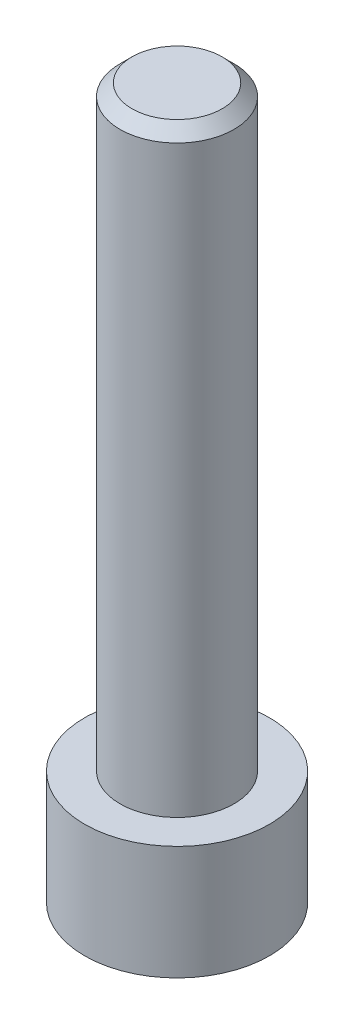
ISO-10303-21;
HEADER;
FILE_DESCRIPTION(('STEP AP214'),'2;1');
FILE_NAME('part.step','',(''),(''),'','','');
FILE_SCHEMA(('AUTOMOTIVE_DESIGN { 1 0 10303 214 1 1 1 1 }'));
ENDSEC;
DATA;
#1=APPLICATION_CONTEXT('core data for automotive mechanical design processes');
#2=APPLICATION_PROTOCOL_DEFINITION('international standard','automotive_design',2000,#1);
#3=PRODUCT_CONTEXT('',#1,'mechanical');
#4=PRODUCT('Part','Part','',(#3));
#5=PRODUCT_RELATED_PRODUCT_CATEGORY('part','',(#4));
#6=PRODUCT_DEFINITION_FORMATION('','',#4);
#7=PRODUCT_DEFINITION_CONTEXT('part definition',#1,'design');
#8=PRODUCT_DEFINITION('design','',#6,#7);
#9=PRODUCT_DEFINITION_SHAPE('','',#8);
#10=(LENGTH_UNIT() NAMED_UNIT(*) SI_UNIT(.MILLI.,.METRE.));
#11=(NAMED_UNIT(*) PLANE_ANGLE_UNIT() SI_UNIT($,.RADIAN.));
#12=(NAMED_UNIT(*) SI_UNIT($,.STERADIAN.) SOLID_ANGLE_UNIT());
#13=UNCERTAINTY_MEASURE_WITH_UNIT(LENGTH_MEASURE(1.E-05),#10,'distance_accuracy_value','');
#14=(GEOMETRIC_REPRESENTATION_CONTEXT(3) GLOBAL_UNCERTAINTY_ASSIGNED_CONTEXT((#13)) GLOBAL_UNIT_ASSIGNED_CONTEXT((#10,
#11,#12)) REPRESENTATION_CONTEXT('',''));
#15=CARTESIAN_POINT('',(0.,0.,0.));
#16=DIRECTION('',(0.,0.,1.));
#17=DIRECTION('',(1.,0.,0.));
#18=AXIS2_PLACEMENT_3D('',#15,#16,#17);
#19=CARTESIAN_POINT('',(0.,29.78,0.));
#20=DIRECTION('',(0.,-1.,0.));
#21=DIRECTION('',(0.,0.,-1.));
#22=AXIS2_PLACEMENT_3D('',#19,#20,#21);
#23=CYLINDRICAL_SURFACE('',#22,3.875);
#24=CARTESIAN_POINT('',(0.,0.,0.));
#25=DIRECTION('',(0.,1.,0.));
#26=DIRECTION('',(0.,0.,1.));
#27=AXIS2_PLACEMENT_3D('',#24,#25,#26);
#28=CIRCLE('',#27,3.875);
#29=CARTESIAN_POINT('',(0.,0.,3.875));
#30=VERTEX_POINT('',#29);
#31=EDGE_CURVE('E145',#30,#30,#28,.T.);
#32=ORIENTED_EDGE('',*,*,#31,.T.);
#33=EDGE_LOOP('',(#32));
#34=FACE_BOUND('',#33,.T.);
#35=CARTESIAN_POINT('',(0.,4.78,0.));
#36=DIRECTION('',(0.,1.,0.));
#37=DIRECTION('',(0.,0.,1.));
#38=AXIS2_PLACEMENT_3D('',#35,#36,#37);
#39=CIRCLE('',#38,3.875);
#40=CARTESIAN_POINT('',(0.,4.78,3.875));
#41=VERTEX_POINT('',#40);
#42=EDGE_CURVE('E144',#41,#41,#39,.T.);
#43=ORIENTED_EDGE('',*,*,#42,.F.);
#44=EDGE_LOOP('',(#43));
#45=FACE_BOUND('',#44,.T.);
#46=ADVANCED_FACE('F34',(#34,#45),#23,.T.);
#47=CARTESIAN_POINT('',(0.,0.,0.));
#48=DIRECTION('',(0.,1.,0.));
#49=DIRECTION('',(0.,0.,1.));
#50=AXIS2_PLACEMENT_3D('',#47,#48,#49);
#51=PLANE('',#50);
#52=DIRECTION('',(-0.5,0.,0.866025403784439));
#53=VECTOR('',#52,1.);
#54=CARTESIAN_POINT('',(2.64426423288849,0.,0.));
#55=LINE('',#54,#53);
#56=CARTESIAN_POINT('',(2.64426423288849,0.,0.));
#57=VERTEX_POINT('',#56);
#58=CARTESIAN_POINT('',(1.32213211644424,0.,2.29));
#59=VERTEX_POINT('',#58);
#60=EDGE_CURVE('E123',#57,#59,#55,.T.);
#61=ORIENTED_EDGE('',*,*,#60,.F.);
#62=DIRECTION('',(0.5,0.,0.866025403784439));
#63=VECTOR('',#62,1.);
#64=CARTESIAN_POINT('',(1.32213211644424,0.,-2.29));
#65=LINE('',#64,#63);
#66=CARTESIAN_POINT('',(1.32213211644424,0.,-2.29));
#67=VERTEX_POINT('',#66);
#68=EDGE_CURVE('E49',#67,#57,#65,.T.);
#69=ORIENTED_EDGE('',*,*,#68,.F.);
#70=DIRECTION('',(1.,0.,0.));
#71=VECTOR('',#70,1.);
#72=CARTESIAN_POINT('',(-1.32213211644424,0.,-2.29));
#73=LINE('',#72,#71);
#74=CARTESIAN_POINT('',(-1.32213211644424,0.,-2.29));
#75=VERTEX_POINT('',#74);
#76=EDGE_CURVE('E132',#75,#67,#73,.T.);
#77=ORIENTED_EDGE('',*,*,#76,.F.);
#78=DIRECTION('',(0.5,0.,-0.866025403784439));
#79=VECTOR('',#78,1.);
#80=CARTESIAN_POINT('',(-2.64426423288849,0.,0.));
#81=LINE('',#80,#79);
#82=CARTESIAN_POINT('',(-2.64426423288849,0.,0.));
#83=VERTEX_POINT('',#82);
#84=EDGE_CURVE('E130',#83,#75,#81,.T.);
#85=ORIENTED_EDGE('',*,*,#84,.F.);
#86=DIRECTION('',(-0.5,0.,-0.866025403784439));
#87=VECTOR('',#86,1.);
#88=CARTESIAN_POINT('',(-1.32213211644424,0.,2.29));
#89=LINE('',#88,#87);
#90=CARTESIAN_POINT('',(-1.32213211644424,0.,2.29));
#91=VERTEX_POINT('',#90);
#92=EDGE_CURVE('E97',#91,#83,#89,.T.);
#93=ORIENTED_EDGE('',*,*,#92,.F.);
#94=DIRECTION('',(-1.,0.,0.));
#95=VECTOR('',#94,1.);
#96=CARTESIAN_POINT('',(1.32213211644424,0.,2.29));
#97=LINE('',#96,#95);
#98=EDGE_CURVE('E126',#59,#91,#97,.T.);
#99=ORIENTED_EDGE('',*,*,#98,.F.);
#100=EDGE_LOOP('',(#61,#69,#77,#85,#93,#99));
#101=FACE_BOUND('',#100,.T.);
#102=ORIENTED_EDGE('',*,*,#31,.F.);
#103=EDGE_LOOP('',(#102));
#104=FACE_BOUND('',#103,.T.);
#105=ADVANCED_FACE('F167',(#101,#104),#51,.F.);
#106=CARTESIAN_POINT('',(0.,4.78,0.));
#107=DIRECTION('',(0.,1.,0.));
#108=DIRECTION('',(0.,0.,1.));
#109=AXIS2_PLACEMENT_3D('',#106,#107,#108);
#110=PLANE('',#109);
#111=CARTESIAN_POINT('',(0.,4.78,0.));
#112=DIRECTION('',(0.,1.,0.));
#113=DIRECTION('',(0.,0.,1.));
#114=AXIS2_PLACEMENT_3D('',#111,#112,#113);
#115=CIRCLE('',#114,2.39);
#116=CARTESIAN_POINT('',(0.,4.78,2.39));
#117=VERTEX_POINT('',#116);
#118=EDGE_CURVE('E136',#117,#117,#115,.T.);
#119=ORIENTED_EDGE('',*,*,#118,.F.);
#120=EDGE_LOOP('',(#119));
#121=FACE_BOUND('',#120,.T.);
#122=ORIENTED_EDGE('',*,*,#42,.T.);
#123=EDGE_LOOP('',(#122));
#124=FACE_BOUND('',#123,.T.);
#125=ADVANCED_FACE('F172',(#121,#124),#110,.T.);
#126=CARTESIAN_POINT('',(0.,4.78,0.));
#127=DIRECTION('',(0.,1.,0.));
#128=DIRECTION('',(0.,0.,1.));
#129=AXIS2_PLACEMENT_3D('',#126,#127,#128);
#130=CYLINDRICAL_SURFACE('',#129,2.39);
#131=CARTESIAN_POINT('',(0.,29.28,0.));
#132=DIRECTION('',(0.,1.,0.));
#133=DIRECTION('',(0.,0.,1.));
#134=AXIS2_PLACEMENT_3D('',#131,#132,#133);
#135=CIRCLE('',#134,2.39);
#136=CARTESIAN_POINT('',(0.,29.28,2.39));
#137=VERTEX_POINT('',#136);
#138=EDGE_CURVE('E12',#137,#137,#135,.F.);
#139=ORIENTED_EDGE('',*,*,#138,.T.);
#140=EDGE_LOOP('',(#139));
#141=FACE_BOUND('',#140,.T.);
#142=ORIENTED_EDGE('',*,*,#118,.T.);
#143=EDGE_LOOP('',(#142));
#144=FACE_BOUND('',#143,.T.);
#145=ADVANCED_FACE('F163',(#141,#144),#130,.T.);
#146=CARTESIAN_POINT('',(0.,29.78,0.));
#147=DIRECTION('',(0.,1.,0.));
#148=DIRECTION('',(0.,0.,1.));
#149=AXIS2_PLACEMENT_3D('',#146,#147,#148);
#150=PLANE('',#149);
#151=CARTESIAN_POINT('',(0.,29.78,0.));
#152=DIRECTION('',(0.,1.,0.));
#153=DIRECTION('',(0.,0.,1.));
#154=AXIS2_PLACEMENT_3D('',#151,#152,#153);
#155=CIRCLE('',#154,1.89);
#156=CARTESIAN_POINT('',(0.,29.78,1.89));
#157=VERTEX_POINT('',#156);
#158=EDGE_CURVE('E42',#157,#157,#155,.T.);
#159=ORIENTED_EDGE('',*,*,#158,.T.);
#160=EDGE_LOOP('',(#159));
#161=FACE_BOUND('',#160,.T.);
#162=ADVANCED_FACE('F152',(#161),#150,.T.);
#163=CARTESIAN_POINT('',(0.,29.78,0.));
#164=DIRECTION('',(0.,-1.,0.));
#165=DIRECTION('',(0.,0.,-1.));
#166=AXIS2_PLACEMENT_3D('',#163,#164,#165);
#167=CONICAL_SURFACE('',#166,1.89,0.785398163397442);
#168=ORIENTED_EDGE('',*,*,#138,.F.);
#169=EDGE_LOOP('',(#168));
#170=FACE_BOUND('',#169,.T.);
#171=ORIENTED_EDGE('',*,*,#158,.F.);
#172=EDGE_LOOP('',(#171));
#173=FACE_BOUND('',#172,.T.);
#174=ADVANCED_FACE('F36',(#170,#173),#167,.T.);
#175=CARTESIAN_POINT('',(1.32213211644424,3.36,-2.29));
#176=DIRECTION('',(0.866025403784439,0.,-0.5));
#177=DIRECTION('',(-0.5,0.,-0.866025403784439));
#178=AXIS2_PLACEMENT_3D('',#175,#176,#177);
#179=PLANE('',#178);
#180=ORIENTED_EDGE('',*,*,#68,.T.);
#181=DIRECTION('',(0.,-1.,0.));
#182=VECTOR('',#181,1.);
#183=CARTESIAN_POINT('',(2.64426423288849,3.36,0.));
#184=LINE('',#183,#182);
#185=CARTESIAN_POINT('',(2.64426423288849,3.36,0.));
#186=VERTEX_POINT('',#185);
#187=EDGE_CURVE('E79',#186,#57,#184,.T.);
#188=ORIENTED_EDGE('',*,*,#187,.F.);
#189=DIRECTION('',(0.5,0.,0.866025403784439));
#190=VECTOR('',#189,1.);
#191=CARTESIAN_POINT('',(1.32213211644424,3.36,-2.29));
#192=LINE('',#191,#190);
#193=CARTESIAN_POINT('',(1.32213211644424,3.36,-2.29));
#194=VERTEX_POINT('',#193);
#195=EDGE_CURVE('E134',#194,#186,#192,.T.);
#196=ORIENTED_EDGE('',*,*,#195,.F.);
#197=DIRECTION('',(0.,-1.,0.));
#198=VECTOR('',#197,1.);
#199=CARTESIAN_POINT('',(1.32213211644424,3.36,-2.29));
#200=LINE('',#199,#198);
#201=EDGE_CURVE('E57',#194,#67,#200,.T.);
#202=ORIENTED_EDGE('',*,*,#201,.T.);
#203=EDGE_LOOP('',(#180,#188,#196,#202));
#204=FACE_BOUND('',#203,.T.);
#205=ADVANCED_FACE('F155',(#204),#179,.F.);
#206=CARTESIAN_POINT('',(-1.32213211644424,3.36,-2.29));
#207=DIRECTION('',(0.,0.,-1.));
#208=DIRECTION('',(-1.,0.,0.));
#209=AXIS2_PLACEMENT_3D('',#206,#207,#208);
#210=PLANE('',#209);
#211=ORIENTED_EDGE('',*,*,#76,.T.);
#212=ORIENTED_EDGE('',*,*,#201,.F.);
#213=DIRECTION('',(1.,0.,0.));
#214=VECTOR('',#213,1.);
#215=CARTESIAN_POINT('',(-1.32213211644424,3.36,-2.29));
#216=LINE('',#215,#214);
#217=CARTESIAN_POINT('',(-1.32213211644424,3.36,-2.29));
#218=VERTEX_POINT('',#217);
#219=EDGE_CURVE('E109',#218,#194,#216,.T.);
#220=ORIENTED_EDGE('',*,*,#219,.F.);
#221=DIRECTION('',(0.,-1.,0.));
#222=VECTOR('',#221,1.);
#223=CARTESIAN_POINT('',(-1.32213211644424,3.36,-2.29));
#224=LINE('',#223,#222);
#225=EDGE_CURVE('E101',#218,#75,#224,.T.);
#226=ORIENTED_EDGE('',*,*,#225,.T.);
#227=EDGE_LOOP('',(#211,#212,#220,#226));
#228=FACE_BOUND('',#227,.T.);
#229=ADVANCED_FACE('F161',(#228),#210,.F.);
#230=CARTESIAN_POINT('',(-2.64426423288849,3.36,0.));
#231=DIRECTION('',(-0.866025403784438,0.,-0.5));
#232=DIRECTION('',(-0.5,0.,0.866025403784439));
#233=AXIS2_PLACEMENT_3D('',#230,#231,#232);
#234=PLANE('',#233);
#235=ORIENTED_EDGE('',*,*,#84,.T.);
#236=ORIENTED_EDGE('',*,*,#225,.F.);
#237=DIRECTION('',(0.5,0.,-0.866025403784439));
#238=VECTOR('',#237,1.);
#239=CARTESIAN_POINT('',(-2.64426423288849,3.36,0.));
#240=LINE('',#239,#238);
#241=CARTESIAN_POINT('',(-2.64426423288849,3.36,0.));
#242=VERTEX_POINT('',#241);
#243=EDGE_CURVE('E105',#242,#218,#240,.T.);
#244=ORIENTED_EDGE('',*,*,#243,.F.);
#245=DIRECTION('',(0.,-1.,0.));
#246=VECTOR('',#245,1.);
#247=CARTESIAN_POINT('',(-2.64426423288849,3.36,0.));
#248=LINE('',#247,#246);
#249=EDGE_CURVE('E90',#242,#83,#248,.T.);
#250=ORIENTED_EDGE('',*,*,#249,.T.);
#251=EDGE_LOOP('',(#235,#236,#244,#250));
#252=FACE_BOUND('',#251,.T.);
#253=ADVANCED_FACE('F106',(#252),#234,.F.);
#254=CARTESIAN_POINT('',(-1.32213211644424,3.36,2.29));
#255=DIRECTION('',(-0.866025403784439,0.,0.5));
#256=DIRECTION('',(0.5,0.,0.866025403784439));
#257=AXIS2_PLACEMENT_3D('',#254,#255,#256);
#258=PLANE('',#257);
#259=ORIENTED_EDGE('',*,*,#92,.T.);
#260=ORIENTED_EDGE('',*,*,#249,.F.);
#261=DIRECTION('',(-0.5,0.,-0.866025403784439));
#262=VECTOR('',#261,1.);
#263=CARTESIAN_POINT('',(-1.32213211644424,3.36,2.29));
#264=LINE('',#263,#262);
#265=CARTESIAN_POINT('',(-1.32213211644424,3.36,2.29));
#266=VERTEX_POINT('',#265);
#267=EDGE_CURVE('E94',#266,#242,#264,.T.);
#268=ORIENTED_EDGE('',*,*,#267,.F.);
#269=DIRECTION('',(0.,-1.,0.));
#270=VECTOR('',#269,1.);
#271=CARTESIAN_POINT('',(-1.32213211644424,3.36,2.29));
#272=LINE('',#271,#270);
#273=EDGE_CURVE('E102',#266,#91,#272,.T.);
#274=ORIENTED_EDGE('',*,*,#273,.T.);
#275=EDGE_LOOP('',(#259,#260,#268,#274));
#276=FACE_BOUND('',#275,.T.);
#277=ADVANCED_FACE('F92',(#276),#258,.F.);
#278=CARTESIAN_POINT('',(1.32213211644424,3.36,2.29));
#279=DIRECTION('',(0.,0.,1.));
#280=DIRECTION('',(1.,0.,0.));
#281=AXIS2_PLACEMENT_3D('',#278,#279,#280);
#282=PLANE('',#281);
#283=ORIENTED_EDGE('',*,*,#98,.T.);
#284=ORIENTED_EDGE('',*,*,#273,.F.);
#285=DIRECTION('',(-1.,0.,0.));
#286=VECTOR('',#285,1.);
#287=CARTESIAN_POINT('',(1.32213211644424,3.36,2.29));
#288=LINE('',#287,#286);
#289=CARTESIAN_POINT('',(1.32213211644424,3.36,2.29));
#290=VERTEX_POINT('',#289);
#291=EDGE_CURVE('E115',#290,#266,#288,.T.);
#292=ORIENTED_EDGE('',*,*,#291,.F.);
#293=DIRECTION('',(0.,-1.,0.));
#294=VECTOR('',#293,1.);
#295=CARTESIAN_POINT('',(1.32213211644424,3.36,2.29));
#296=LINE('',#295,#294);
#297=EDGE_CURVE('E139',#290,#59,#296,.T.);
#298=ORIENTED_EDGE('',*,*,#297,.T.);
#299=EDGE_LOOP('',(#283,#284,#292,#298));
#300=FACE_BOUND('',#299,.T.);
#301=ADVANCED_FACE('F186',(#300),#282,.F.);
#302=CARTESIAN_POINT('',(2.64426423288849,3.36,0.));
#303=DIRECTION('',(0.866025403784439,0.,0.5));
#304=DIRECTION('',(0.5,0.,-0.866025403784439));
#305=AXIS2_PLACEMENT_3D('',#302,#303,#304);
#306=PLANE('',#305);
#307=ORIENTED_EDGE('',*,*,#60,.T.);
#308=ORIENTED_EDGE('',*,*,#297,.F.);
#309=DIRECTION('',(-0.5,0.,0.866025403784439));
#310=VECTOR('',#309,1.);
#311=CARTESIAN_POINT('',(2.64426423288849,3.36,0.));
#312=LINE('',#311,#310);
#313=EDGE_CURVE('E117',#186,#290,#312,.T.);
#314=ORIENTED_EDGE('',*,*,#313,.F.);
#315=ORIENTED_EDGE('',*,*,#187,.T.);
#316=EDGE_LOOP('',(#307,#308,#314,#315));
#317=FACE_BOUND('',#316,.T.);
#318=ADVANCED_FACE('F183',(#317),#306,.F.);
#319=CARTESIAN_POINT('',(0.,3.36,0.));
#320=DIRECTION('',(0.,-1.,0.));
#321=DIRECTION('',(0.,0.,-1.));
#322=AXIS2_PLACEMENT_3D('',#319,#320,#321);
#323=PLANE('',#322);
#324=ORIENTED_EDGE('',*,*,#195,.T.);
#325=ORIENTED_EDGE('',*,*,#313,.T.);
#326=ORIENTED_EDGE('',*,*,#291,.T.);
#327=ORIENTED_EDGE('',*,*,#267,.T.);
#328=ORIENTED_EDGE('',*,*,#243,.T.);
#329=ORIENTED_EDGE('',*,*,#219,.T.);
#330=EDGE_LOOP('',(#324,#325,#326,#327,#328,#329));
#331=FACE_BOUND('',#330,.T.);
#332=ADVANCED_FACE('F112',(#331),#323,.T.);
#333=CLOSED_SHELL('',(#46,#105,#125,#145,#162,#174,#205,#229,#253,#277,#301,#318,#332));
#334=MANIFOLD_SOLID_BREP('B2',#333);
#335=ADVANCED_BREP_SHAPE_REPRESENTATION('',(#18,#334),#14);
#336=SHAPE_DEFINITION_REPRESENTATION(#9,#335);
ENDSEC;
END-ISO-10303-21;
